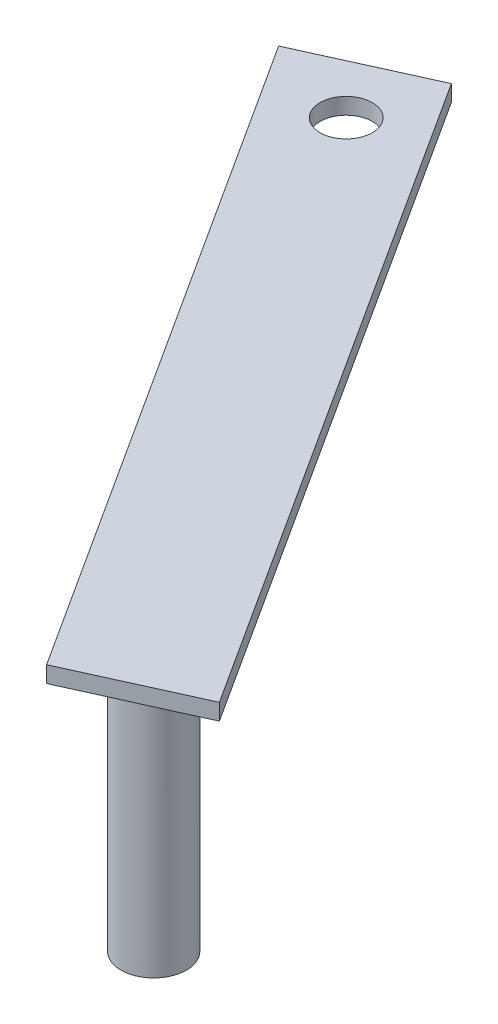
ISO-10303-21;
HEADER;
FILE_DESCRIPTION(('STEP AP214'),'2;1');
FILE_NAME('part.step','',(''),(''),'','','');
FILE_SCHEMA(('AUTOMOTIVE_DESIGN { 1 0 10303 214 1 1 1 1 }'));
ENDSEC;
DATA;
#1=APPLICATION_CONTEXT('core data for automotive mechanical design processes');
#2=APPLICATION_PROTOCOL_DEFINITION('international standard','automotive_design',2000,#1);
#3=PRODUCT_CONTEXT('',#1,'mechanical');
#4=PRODUCT('Part','Part','',(#3));
#5=PRODUCT_RELATED_PRODUCT_CATEGORY('part','',(#4));
#6=PRODUCT_DEFINITION_FORMATION('','',#4);
#7=PRODUCT_DEFINITION_CONTEXT('part definition',#1,'design');
#8=PRODUCT_DEFINITION('design','',#6,#7);
#9=PRODUCT_DEFINITION_SHAPE('','',#8);
#10=(LENGTH_UNIT() NAMED_UNIT(*) SI_UNIT(.MILLI.,.METRE.));
#11=(NAMED_UNIT(*) PLANE_ANGLE_UNIT() SI_UNIT($,.RADIAN.));
#12=(NAMED_UNIT(*) SI_UNIT($,.STERADIAN.) SOLID_ANGLE_UNIT());
#13=UNCERTAINTY_MEASURE_WITH_UNIT(LENGTH_MEASURE(1.E-05),#10,'distance_accuracy_value','');
#14=(GEOMETRIC_REPRESENTATION_CONTEXT(3) GLOBAL_UNCERTAINTY_ASSIGNED_CONTEXT((#13)) GLOBAL_UNIT_ASSIGNED_CONTEXT((#10,
#11,#12)) REPRESENTATION_CONTEXT('',''));
#15=CARTESIAN_POINT('',(0.,0.,0.));
#16=DIRECTION('',(0.,0.,1.));
#17=DIRECTION('',(1.,0.,0.));
#18=AXIS2_PLACEMENT_3D('',#15,#16,#17);
#19=CARTESIAN_POINT('',(0.,3.175,0.));
#20=DIRECTION('',(0.,-1.,0.));
#21=DIRECTION('',(0.,0.,-1.));
#22=AXIS2_PLACEMENT_3D('',#19,#20,#21);
#23=PLANE('',#22);
#24=DIRECTION('',(-0.91105944434931,0.,0.412275016053516));
#25=VECTOR('',#24,1.);
#26=CARTESIAN_POINT('',(-128.460753108732,3.175,-73.1009565929248));
#27=LINE('',#26,#25);
#28=CARTESIAN_POINT('',(-105.319843222259,3.175,-83.5727420006842));
#29=VERTEX_POINT('',#28);
#30=CARTESIAN_POINT('',(-128.460753108732,3.175,-73.1009565929248));
#31=VERTEX_POINT('',#30);
#32=EDGE_CURVE('E85',#29,#31,#27,.T.);
#33=ORIENTED_EDGE('',*,*,#32,.T.);
#34=DIRECTION('',(0.5414887466698,0.,0.840707997600813));
#35=VECTOR('',#34,1.);
#36=CARTESIAN_POINT('',(-46.7771756735924,3.175,53.7198448451578));
#37=LINE('',#36,#35);
#38=CARTESIAN_POINT('',(-46.7771756735924,3.175,53.7198448451578));
#39=VERTEX_POINT('',#38);
#40=EDGE_CURVE('E80',#31,#39,#37,.T.);
#41=ORIENTED_EDGE('',*,*,#40,.T.);
#42=DIRECTION('',(0.91105944434931,0.,-0.412275016053516));
#43=VECTOR('',#42,1.);
#44=CARTESIAN_POINT('',(-23.6362657871199,3.175,43.2480594373985));
#45=LINE('',#44,#43);
#46=CARTESIAN_POINT('',(-23.6362657871199,3.175,43.2480594373985));
#47=VERTEX_POINT('',#46);
#48=EDGE_CURVE('E83',#39,#47,#45,.T.);
#49=ORIENTED_EDGE('',*,*,#48,.T.);
#50=DIRECTION('',(-0.5414887466698,0.,-0.840707997600813));
#51=VECTOR('',#50,1.);
#52=CARTESIAN_POINT('',(-105.319843222259,3.175,-83.5727420006842));
#53=LINE('',#52,#51);
#54=EDGE_CURVE('E49',#47,#29,#53,.T.);
#55=ORIENTED_EDGE('',*,*,#54,.T.);
#56=EDGE_LOOP('',(#33,#41,#49,#55));
#57=FACE_BOUND('',#56,.T.);
#58=CARTESIAN_POINT('',(-109.811555344914,3.175,-67.6003257354992));
#59=DIRECTION('',(0.,1.,0.));
#60=DIRECTION('',(0.,0.,1.));
#61=AXIS2_PLACEMENT_3D('',#58,#59,#60);
#62=CIRCLE('',#61,5.07829890335643);
#63=CARTESIAN_POINT('',(-109.811555344914,3.175,-62.5220268321427));
#64=VERTEX_POINT('',#63);
#65=EDGE_CURVE('E102',#64,#64,#62,.T.);
#66=ORIENTED_EDGE('',*,*,#65,.F.);
#67=EDGE_LOOP('',(#66));
#68=FACE_BOUND('',#67,.T.);
#69=ADVANCED_FACE('F32',(#57,#68),#23,.F.);
#70=CARTESIAN_POINT('',(0.,0.,0.));
#71=DIRECTION('',(0.,-1.,0.));
#72=DIRECTION('',(0.,0.,-1.));
#73=AXIS2_PLACEMENT_3D('',#70,#71,#72);
#74=PLANE('',#73);
#75=CARTESIAN_POINT('',(-42.0322749044815,0.,37.632854987734));
#76=DIRECTION('',(0.,-1.,0.));
#77=DIRECTION('',(0.,0.,-1.));
#78=AXIS2_PLACEMENT_3D('',#75,#76,#77);
#79=CIRCLE('',#78,6.35);
#80=CARTESIAN_POINT('',(-42.0322749044815,0.,31.282854987734));
#81=VERTEX_POINT('',#80);
#82=EDGE_CURVE('E11',#81,#81,#79,.T.);
#83=ORIENTED_EDGE('',*,*,#82,.F.);
#84=EDGE_LOOP('',(#83));
#85=FACE_BOUND('',#84,.T.);
#86=DIRECTION('',(-0.91105944434931,0.,0.412275016053516));
#87=VECTOR('',#86,1.);
#88=CARTESIAN_POINT('',(-128.460753108732,0.,-73.1009565929248));
#89=LINE('',#88,#87);
#90=CARTESIAN_POINT('',(-105.319843222259,0.,-83.5727420006842));
#91=VERTEX_POINT('',#90);
#92=CARTESIAN_POINT('',(-128.460753108732,0.,-73.1009565929248));
#93=VERTEX_POINT('',#92);
#94=EDGE_CURVE('E99',#91,#93,#89,.T.);
#95=ORIENTED_EDGE('',*,*,#94,.F.);
#96=DIRECTION('',(-0.5414887466698,0.,-0.840707997600813));
#97=VECTOR('',#96,1.);
#98=CARTESIAN_POINT('',(-105.319843222259,0.,-83.5727420006842));
#99=LINE('',#98,#97);
#100=CARTESIAN_POINT('',(-23.6362657871199,0.,43.2480594373985));
#101=VERTEX_POINT('',#100);
#102=EDGE_CURVE('E72',#101,#91,#99,.T.);
#103=ORIENTED_EDGE('',*,*,#102,.F.);
#104=DIRECTION('',(0.91105944434931,0.,-0.412275016053516));
#105=VECTOR('',#104,1.);
#106=CARTESIAN_POINT('',(-23.6362657871199,0.,43.2480594373985));
#107=LINE('',#106,#105);
#108=CARTESIAN_POINT('',(-46.7771756735924,0.,53.7198448451578));
#109=VERTEX_POINT('',#108);
#110=EDGE_CURVE('E66',#109,#101,#107,.T.);
#111=ORIENTED_EDGE('',*,*,#110,.F.);
#112=DIRECTION('',(0.5414887466698,0.,0.840707997600813));
#113=VECTOR('',#112,1.);
#114=CARTESIAN_POINT('',(-46.7771756735924,0.,53.7198448451578));
#115=LINE('',#114,#113);
#116=EDGE_CURVE('E90',#93,#109,#115,.T.);
#117=ORIENTED_EDGE('',*,*,#116,.F.);
#118=EDGE_LOOP('',(#95,#103,#111,#117));
#119=FACE_BOUND('',#118,.T.);
#120=CARTESIAN_POINT('',(-109.811555344914,0.,-67.6003257354992));
#121=DIRECTION('',(0.,1.,0.));
#122=DIRECTION('',(0.,0.,1.));
#123=AXIS2_PLACEMENT_3D('',#120,#121,#122);
#124=CIRCLE('',#123,5.07829890335643);
#125=CARTESIAN_POINT('',(-109.811555344914,0.,-62.5220268321427));
#126=VERTEX_POINT('',#125);
#127=EDGE_CURVE('E117',#126,#126,#124,.T.);
#128=ORIENTED_EDGE('',*,*,#127,.T.);
#129=EDGE_LOOP('',(#128));
#130=FACE_BOUND('',#129,.T.);
#131=ADVANCED_FACE('F110',(#85,#119,#130),#74,.T.);
#132=CARTESIAN_POINT('',(-128.460753108732,3.175,-73.1009565929248));
#133=DIRECTION('',(0.412275016053516,0.,0.91105944434931));
#134=DIRECTION('',(0.91105944434931,0.,-0.412275016053516));
#135=AXIS2_PLACEMENT_3D('',#132,#133,#134);
#136=PLANE('',#135);
#137=ORIENTED_EDGE('',*,*,#94,.T.);
#138=DIRECTION('',(0.,-1.,0.));
#139=VECTOR('',#138,1.);
#140=CARTESIAN_POINT('',(-128.460753108732,3.175,-73.1009565929248));
#141=LINE('',#140,#139);
#142=EDGE_CURVE('E41',#31,#93,#141,.T.);
#143=ORIENTED_EDGE('',*,*,#142,.F.);
#144=ORIENTED_EDGE('',*,*,#32,.F.);
#145=DIRECTION('',(0.,-1.,0.));
#146=VECTOR('',#145,1.);
#147=CARTESIAN_POINT('',(-105.319843222259,3.175,-83.5727420006842));
#148=LINE('',#147,#146);
#149=EDGE_CURVE('E95',#29,#91,#148,.T.);
#150=ORIENTED_EDGE('',*,*,#149,.T.);
#151=EDGE_LOOP('',(#137,#143,#144,#150));
#152=FACE_BOUND('',#151,.T.);
#153=ADVANCED_FACE('F34',(#152),#136,.F.);
#154=CARTESIAN_POINT('',(-46.7771756735924,3.175,53.7198448451578));
#155=DIRECTION('',(0.840707997600813,0.,-0.5414887466698));
#156=DIRECTION('',(-0.5414887466698,0.,-0.840707997600814));
#157=AXIS2_PLACEMENT_3D('',#154,#155,#156);
#158=PLANE('',#157);
#159=ORIENTED_EDGE('',*,*,#116,.T.);
#160=DIRECTION('',(0.,-1.,0.));
#161=VECTOR('',#160,1.);
#162=CARTESIAN_POINT('',(-46.7771756735924,3.175,53.7198448451578));
#163=LINE('',#162,#161);
#164=EDGE_CURVE('E88',#39,#109,#163,.T.);
#165=ORIENTED_EDGE('',*,*,#164,.F.);
#166=ORIENTED_EDGE('',*,*,#40,.F.);
#167=ORIENTED_EDGE('',*,*,#142,.T.);
#168=EDGE_LOOP('',(#159,#165,#166,#167));
#169=FACE_BOUND('',#168,.T.);
#170=ADVANCED_FACE('F89',(#169),#158,.F.);
#171=CARTESIAN_POINT('',(-23.6362657871199,3.175,43.2480594373985));
#172=DIRECTION('',(-0.412275016053516,0.,-0.91105944434931));
#173=DIRECTION('',(-0.91105944434931,0.,0.412275016053516));
#174=AXIS2_PLACEMENT_3D('',#171,#172,#173);
#175=PLANE('',#174);
#176=ORIENTED_EDGE('',*,*,#110,.T.);
#177=DIRECTION('',(0.,-1.,0.));
#178=VECTOR('',#177,1.);
#179=CARTESIAN_POINT('',(-23.6362657871199,3.175,43.2480594373985));
#180=LINE('',#179,#178);
#181=EDGE_CURVE('E91',#47,#101,#180,.T.);
#182=ORIENTED_EDGE('',*,*,#181,.F.);
#183=ORIENTED_EDGE('',*,*,#48,.F.);
#184=ORIENTED_EDGE('',*,*,#164,.T.);
#185=EDGE_LOOP('',(#176,#182,#183,#184));
#186=FACE_BOUND('',#185,.T.);
#187=ADVANCED_FACE('F93',(#186),#175,.F.);
#188=CARTESIAN_POINT('',(-105.319843222259,3.175,-83.5727420006842));
#189=DIRECTION('',(-0.840707997600813,0.,0.5414887466698));
#190=DIRECTION('',(0.5414887466698,0.,0.840707997600813));
#191=AXIS2_PLACEMENT_3D('',#188,#189,#190);
#192=PLANE('',#191);
#193=ORIENTED_EDGE('',*,*,#102,.T.);
#194=ORIENTED_EDGE('',*,*,#149,.F.);
#195=ORIENTED_EDGE('',*,*,#54,.F.);
#196=ORIENTED_EDGE('',*,*,#181,.T.);
#197=EDGE_LOOP('',(#193,#194,#195,#196));
#198=FACE_BOUND('',#197,.T.);
#199=ADVANCED_FACE('F144',(#198),#192,.F.);
#200=CARTESIAN_POINT('',(-109.811555344914,3.175,-67.6003257354992));
#201=DIRECTION('',(0.,-1.,0.));
#202=DIRECTION('',(0.,0.,-1.));
#203=AXIS2_PLACEMENT_3D('',#200,#201,#202);
#204=CYLINDRICAL_SURFACE('',#203,5.07829890335643);
#205=ORIENTED_EDGE('',*,*,#65,.T.);
#206=EDGE_LOOP('',(#205));
#207=FACE_BOUND('',#206,.T.);
#208=ORIENTED_EDGE('',*,*,#127,.F.);
#209=EDGE_LOOP('',(#208));
#210=FACE_BOUND('',#209,.T.);
#211=ADVANCED_FACE('F135',(#207,#210),#204,.F.);
#212=CARTESIAN_POINT('',(-42.0322749044815,-50.8,37.632854987734));
#213=DIRECTION('',(0.,1.,0.));
#214=DIRECTION('',(0.,0.,1.));
#215=AXIS2_PLACEMENT_3D('',#212,#213,#214);
#216=CYLINDRICAL_SURFACE('',#215,6.35);
#217=ORIENTED_EDGE('',*,*,#82,.T.);
#218=EDGE_LOOP('',(#217));
#219=FACE_BOUND('',#218,.T.);
#220=CARTESIAN_POINT('',(-42.0322749044815,-50.8,37.632854987734));
#221=DIRECTION('',(0.,1.,0.));
#222=DIRECTION('',(0.,0.,1.));
#223=AXIS2_PLACEMENT_3D('',#220,#221,#222);
#224=CIRCLE('',#223,6.35);
#225=CARTESIAN_POINT('',(-42.0322749044815,-50.8,43.982854987734));
#226=VERTEX_POINT('',#225);
#227=EDGE_CURVE('E119',#226,#226,#224,.T.);
#228=ORIENTED_EDGE('',*,*,#227,.T.);
#229=EDGE_LOOP('',(#228));
#230=FACE_BOUND('',#229,.T.);
#231=ADVANCED_FACE('F127',(#219,#230),#216,.T.);
#232=CARTESIAN_POINT('',(-42.0322749044815,-50.8,37.632854987734));
#233=DIRECTION('',(0.,1.,0.));
#234=DIRECTION('',(0.,0.,1.));
#235=AXIS2_PLACEMENT_3D('',#232,#233,#234);
#236=PLANE('',#235);
#237=ORIENTED_EDGE('',*,*,#227,.F.);
#238=EDGE_LOOP('',(#237));
#239=FACE_BOUND('',#238,.T.);
#240=ADVANCED_FACE('F129',(#239),#236,.F.);
#241=CLOSED_SHELL('',(#69,#131,#153,#170,#187,#199,#211,#231,#240));
#242=MANIFOLD_SOLID_BREP('B2',#241);
#243=ADVANCED_BREP_SHAPE_REPRESENTATION('',(#18,#242),#14);
#244=SHAPE_DEFINITION_REPRESENTATION(#9,#243);
ENDSEC;
END-ISO-10303-21;
